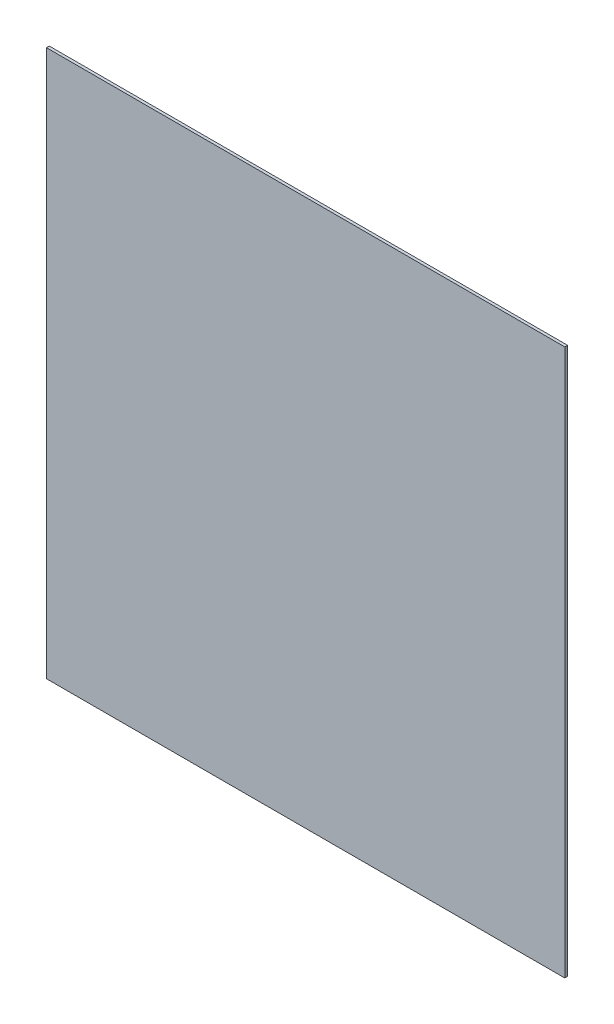
ISO-10303-21;
HEADER;
FILE_DESCRIPTION(('STEP AP214'),'2;1');
FILE_NAME('part.step','',(''),(''),'','','');
FILE_SCHEMA(('AUTOMOTIVE_DESIGN { 1 0 10303 214 1 1 1 1 }'));
ENDSEC;
DATA;
#1=APPLICATION_CONTEXT('core data for automotive mechanical design processes');
#2=APPLICATION_PROTOCOL_DEFINITION('international standard','automotive_design',2000,#1);
#3=PRODUCT_CONTEXT('',#1,'mechanical');
#4=PRODUCT('Part','Part','',(#3));
#5=PRODUCT_RELATED_PRODUCT_CATEGORY('part','',(#4));
#6=PRODUCT_DEFINITION_FORMATION('','',#4);
#7=PRODUCT_DEFINITION_CONTEXT('part definition',#1,'design');
#8=PRODUCT_DEFINITION('design','',#6,#7);
#9=PRODUCT_DEFINITION_SHAPE('','',#8);
#10=(LENGTH_UNIT() NAMED_UNIT(*) SI_UNIT(.MILLI.,.METRE.));
#11=(NAMED_UNIT(*) PLANE_ANGLE_UNIT() SI_UNIT($,.RADIAN.));
#12=(NAMED_UNIT(*) SI_UNIT($,.STERADIAN.) SOLID_ANGLE_UNIT());
#13=UNCERTAINTY_MEASURE_WITH_UNIT(LENGTH_MEASURE(1.E-05),#10,'distance_accuracy_value','');
#14=(GEOMETRIC_REPRESENTATION_CONTEXT(3) GLOBAL_UNCERTAINTY_ASSIGNED_CONTEXT((#13)) GLOBAL_UNIT_ASSIGNED_CONTEXT((#10,
#11,#12)) REPRESENTATION_CONTEXT('',''));
#15=CARTESIAN_POINT('',(0.,0.,0.));
#16=DIRECTION('',(0.,0.,1.));
#17=DIRECTION('',(1.,0.,0.));
#18=AXIS2_PLACEMENT_3D('',#15,#16,#17);
#19=CARTESIAN_POINT('',(184.,194.,0.));
#20=DIRECTION('',(0.,0.,1.));
#21=DIRECTION('',(1.,0.,0.));
#22=AXIS2_PLACEMENT_3D('',#19,#20,#21);
#23=PLANE('',#22);
#24=DIRECTION('',(0.,1.,0.));
#25=VECTOR('',#24,1.);
#26=CARTESIAN_POINT('',(0.,388.,0.));
#27=LINE('',#26,#25);
#28=CARTESIAN_POINT('',(0.,388.,0.));
#29=VERTEX_POINT('',#28);
#30=CARTESIAN_POINT('',(0.,0.,0.));
#31=VERTEX_POINT('',#30);
#32=EDGE_CURVE('E86',#29,#31,#27,.F.);
#33=ORIENTED_EDGE('',*,*,#32,.F.);
#34=DIRECTION('',(1.,0.,0.));
#35=VECTOR('',#34,1.);
#36=CARTESIAN_POINT('',(368.,388.,0.));
#37=LINE('',#36,#35);
#38=CARTESIAN_POINT('',(368.,388.,0.));
#39=VERTEX_POINT('',#38);
#40=EDGE_CURVE('E56',#39,#29,#37,.F.);
#41=ORIENTED_EDGE('',*,*,#40,.F.);
#42=DIRECTION('',(0.,1.,0.));
#43=VECTOR('',#42,1.);
#44=CARTESIAN_POINT('',(368.,0.,0.));
#45=LINE('',#44,#43);
#46=CARTESIAN_POINT('',(368.,0.,0.));
#47=VERTEX_POINT('',#46);
#48=EDGE_CURVE('E58',#47,#39,#45,.T.);
#49=ORIENTED_EDGE('',*,*,#48,.F.);
#50=DIRECTION('',(1.,0.,0.));
#51=VECTOR('',#50,1.);
#52=CARTESIAN_POINT('',(0.,0.,0.));
#53=LINE('',#52,#51);
#54=EDGE_CURVE('E20',#31,#47,#53,.T.);
#55=ORIENTED_EDGE('',*,*,#54,.F.);
#56=EDGE_LOOP('',(#33,#41,#49,#55));
#57=FACE_BOUND('',#56,.T.);
#58=ADVANCED_FACE('F17',(#57),#23,.F.);
#59=CARTESIAN_POINT('',(0.,0.,0.));
#60=DIRECTION('',(0.,-1.,0.));
#61=DIRECTION('',(0.,0.,-1.));
#62=AXIS2_PLACEMENT_3D('',#59,#60,#61);
#63=PLANE('',#62);
#64=DIRECTION('',(1.,0.,0.));
#65=VECTOR('',#64,1.);
#66=CARTESIAN_POINT('',(184.,0.,2.));
#67=LINE('',#66,#65);
#68=CARTESIAN_POINT('',(0.,0.,2.));
#69=VERTEX_POINT('',#68);
#70=CARTESIAN_POINT('',(368.,0.,2.));
#71=VERTEX_POINT('',#70);
#72=EDGE_CURVE('E93',#69,#71,#67,.T.);
#73=ORIENTED_EDGE('',*,*,#72,.F.);
#74=DIRECTION('',(0.,0.,1.));
#75=VECTOR('',#74,1.);
#76=CARTESIAN_POINT('',(0.,0.,0.));
#77=LINE('',#76,#75);
#78=EDGE_CURVE('E70',#31,#69,#77,.T.);
#79=ORIENTED_EDGE('',*,*,#78,.F.);
#80=ORIENTED_EDGE('',*,*,#54,.T.);
#81=DIRECTION('',(0.,0.,-1.));
#82=VECTOR('',#81,1.);
#83=CARTESIAN_POINT('',(368.,0.,0.));
#84=LINE('',#83,#82);
#85=EDGE_CURVE('E65',#71,#47,#84,.T.);
#86=ORIENTED_EDGE('',*,*,#85,.F.);
#87=EDGE_LOOP('',(#73,#79,#80,#86));
#88=FACE_BOUND('',#87,.T.);
#89=ADVANCED_FACE('F67',(#88),#63,.T.);
#90=CARTESIAN_POINT('',(368.,0.,0.));
#91=DIRECTION('',(1.,0.,0.));
#92=DIRECTION('',(0.,0.,-1.));
#93=AXIS2_PLACEMENT_3D('',#90,#91,#92);
#94=PLANE('',#93);
#95=DIRECTION('',(0.,1.,0.));
#96=VECTOR('',#95,1.);
#97=CARTESIAN_POINT('',(368.,194.,2.));
#98=LINE('',#97,#96);
#99=CARTESIAN_POINT('',(368.,388.,2.));
#100=VERTEX_POINT('',#99);
#101=EDGE_CURVE('E75',#71,#100,#98,.T.);
#102=ORIENTED_EDGE('',*,*,#101,.F.);
#103=ORIENTED_EDGE('',*,*,#85,.T.);
#104=ORIENTED_EDGE('',*,*,#48,.T.);
#105=DIRECTION('',(0.,0.,1.));
#106=VECTOR('',#105,1.);
#107=CARTESIAN_POINT('',(368.,388.,0.));
#108=LINE('',#107,#106);
#109=EDGE_CURVE('E81',#100,#39,#108,.F.);
#110=ORIENTED_EDGE('',*,*,#109,.F.);
#111=EDGE_LOOP('',(#102,#103,#104,#110));
#112=FACE_BOUND('',#111,.T.);
#113=ADVANCED_FACE('F73',(#112),#94,.T.);
#114=CARTESIAN_POINT('',(368.,388.,0.));
#115=DIRECTION('',(0.,1.,0.));
#116=DIRECTION('',(0.,0.,1.));
#117=AXIS2_PLACEMENT_3D('',#114,#115,#116);
#118=PLANE('',#117);
#119=DIRECTION('',(1.,0.,0.));
#120=VECTOR('',#119,1.);
#121=CARTESIAN_POINT('',(184.,388.,2.));
#122=LINE('',#121,#120);
#123=CARTESIAN_POINT('',(0.,388.,2.));
#124=VERTEX_POINT('',#123);
#125=EDGE_CURVE('E27',#100,#124,#122,.F.);
#126=ORIENTED_EDGE('',*,*,#125,.F.);
#127=ORIENTED_EDGE('',*,*,#109,.T.);
#128=ORIENTED_EDGE('',*,*,#40,.T.);
#129=DIRECTION('',(0.,0.,1.));
#130=VECTOR('',#129,1.);
#131=CARTESIAN_POINT('',(0.,388.,0.));
#132=LINE('',#131,#130);
#133=EDGE_CURVE('E36',#124,#29,#132,.F.);
#134=ORIENTED_EDGE('',*,*,#133,.F.);
#135=EDGE_LOOP('',(#126,#127,#128,#134));
#136=FACE_BOUND('',#135,.T.);
#137=ADVANCED_FACE('F102',(#136),#118,.T.);
#138=CARTESIAN_POINT('',(0.,388.,0.));
#139=DIRECTION('',(-1.,0.,0.));
#140=DIRECTION('',(0.,0.,1.));
#141=AXIS2_PLACEMENT_3D('',#138,#139,#140);
#142=PLANE('',#141);
#143=DIRECTION('',(0.,1.,0.));
#144=VECTOR('',#143,1.);
#145=CARTESIAN_POINT('',(0.,194.,2.));
#146=LINE('',#145,#144);
#147=EDGE_CURVE('E11',#124,#69,#146,.F.);
#148=ORIENTED_EDGE('',*,*,#147,.F.);
#149=ORIENTED_EDGE('',*,*,#133,.T.);
#150=ORIENTED_EDGE('',*,*,#32,.T.);
#151=ORIENTED_EDGE('',*,*,#78,.T.);
#152=EDGE_LOOP('',(#148,#149,#150,#151));
#153=FACE_BOUND('',#152,.T.);
#154=ADVANCED_FACE('F104',(#153),#142,.T.);
#155=CARTESIAN_POINT('',(184.,194.,2.));
#156=DIRECTION('',(0.,0.,1.));
#157=DIRECTION('',(1.,0.,0.));
#158=AXIS2_PLACEMENT_3D('',#155,#156,#157);
#159=PLANE('',#158);
#160=ORIENTED_EDGE('',*,*,#125,.T.);
#161=ORIENTED_EDGE('',*,*,#147,.T.);
#162=ORIENTED_EDGE('',*,*,#72,.T.);
#163=ORIENTED_EDGE('',*,*,#101,.T.);
#164=EDGE_LOOP('',(#160,#161,#162,#163));
#165=FACE_BOUND('',#164,.T.);
#166=ADVANCED_FACE('F101',(#165),#159,.T.);
#167=CLOSED_SHELL('',(#58,#89,#113,#137,#154,#166));
#168=MANIFOLD_SOLID_BREP('B1',#167);
#169=ADVANCED_BREP_SHAPE_REPRESENTATION('',(#18,#168),#14);
#170=SHAPE_DEFINITION_REPRESENTATION(#9,#169);
ENDSEC;
END-ISO-10303-21;
